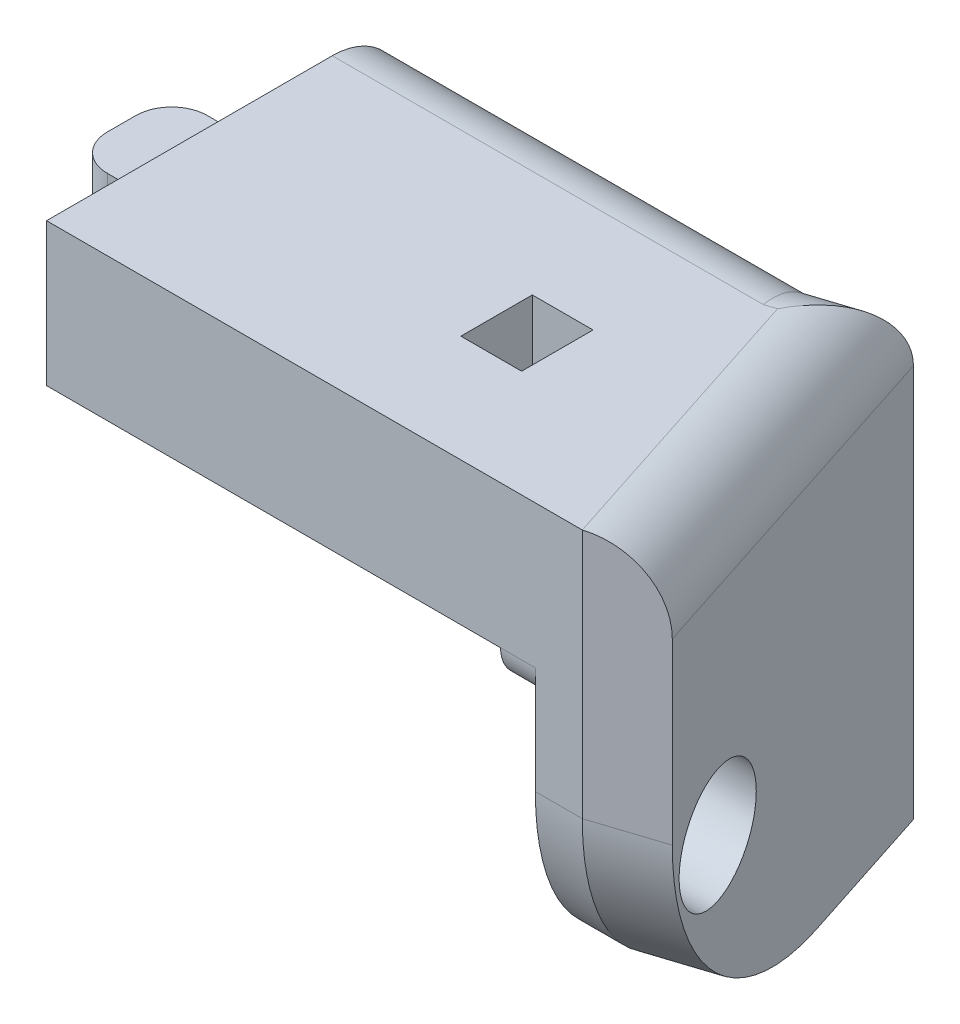
ISO-10303-21;
HEADER;
FILE_DESCRIPTION(('STEP AP214'),'2;1');
FILE_NAME('part.step','',(''),(''),'','','');
FILE_SCHEMA(('AUTOMOTIVE_DESIGN { 1 0 10303 214 1 1 1 1 }'));
ENDSEC;
DATA;
#1=APPLICATION_CONTEXT('core data for automotive mechanical design processes');
#2=APPLICATION_PROTOCOL_DEFINITION('international standard','automotive_design',2000,#1);
#3=PRODUCT_CONTEXT('',#1,'mechanical');
#4=PRODUCT('Part','Part','',(#3));
#5=PRODUCT_RELATED_PRODUCT_CATEGORY('part','',(#4));
#6=PRODUCT_DEFINITION_FORMATION('','',#4);
#7=PRODUCT_DEFINITION_CONTEXT('part definition',#1,'design');
#8=PRODUCT_DEFINITION('design','',#6,#7);
#9=PRODUCT_DEFINITION_SHAPE('','',#8);
#10=(LENGTH_UNIT() NAMED_UNIT(*) SI_UNIT(.MILLI.,.METRE.));
#11=(NAMED_UNIT(*) PLANE_ANGLE_UNIT() SI_UNIT($,.RADIAN.));
#12=(NAMED_UNIT(*) SI_UNIT($,.STERADIAN.) SOLID_ANGLE_UNIT());
#13=UNCERTAINTY_MEASURE_WITH_UNIT(LENGTH_MEASURE(1.E-05),#10,'distance_accuracy_value','');
#14=(GEOMETRIC_REPRESENTATION_CONTEXT(3) GLOBAL_UNCERTAINTY_ASSIGNED_CONTEXT((#13)) GLOBAL_UNIT_ASSIGNED_CONTEXT((#10,
#11,#12)) REPRESENTATION_CONTEXT('',''));
#15=CARTESIAN_POINT('',(0.,0.,0.));
#16=DIRECTION('',(0.,0.,1.));
#17=DIRECTION('',(1.,0.,0.));
#18=AXIS2_PLACEMENT_3D('',#15,#16,#17);
#19=CARTESIAN_POINT('',(0.,20.32,0.));
#20=DIRECTION('',(0.,1.,0.));
#21=DIRECTION('',(0.,0.,1.));
#22=AXIS2_PLACEMENT_3D('',#19,#20,#21);
#23=PLANE('',#22);
#24=DIRECTION('',(1.,0.,0.));
#25=VECTOR('',#24,1.);
#26=CARTESIAN_POINT('',(0.,20.32,22.86));
#27=LINE('',#26,#25);
#28=CARTESIAN_POINT('',(63.7833511252962,20.32,22.86));
#29=VERTEX_POINT('',#28);
#30=CARTESIAN_POINT('',(62.132759068433,20.32,22.86));
#31=VERTEX_POINT('',#30);
#32=EDGE_CURVE('E373',#29,#31,#27,.F.);
#33=ORIENTED_EDGE('',*,*,#32,.T.);
#34=DIRECTION('',(0.,0.,1.));
#35=VECTOR('',#34,1.);
#36=CARTESIAN_POINT('',(62.132759068433,20.32,17.78));
#37=LINE('',#36,#35);
#38=CARTESIAN_POINT('',(62.132759068433,20.32,17.78));
#39=VERTEX_POINT('',#38);
#40=EDGE_CURVE('E226',#39,#31,#37,.T.);
#41=ORIENTED_EDGE('',*,*,#40,.F.);
#42=DIRECTION('',(0.309016994374944,0.,0.951056516295155));
#43=VECTOR('',#42,1.);
#44=CARTESIAN_POINT('',(57.3873069049515,20.32,3.175));
#45=LINE('',#44,#43);
#46=EDGE_CURVE('E375',#39,#29,#45,.T.);
#47=ORIENTED_EDGE('',*,*,#46,.T.);
#48=EDGE_LOOP('',(#33,#41,#47));
#49=FACE_BOUND('',#48,.T.);
#50=ADVANCED_FACE('F33',(#49),#23,.F.);
#51=CARTESIAN_POINT('',(51.6910397156842,12.7,17.78));
#52=DIRECTION('',(0.,0.,1.));
#53=DIRECTION('',(1.,0.,0.));
#54=AXIS2_PLACEMENT_3D('',#51,#52,#53);
#55=PLANE('',#54);
#56=DIRECTION('',(1.,0.,0.));
#57=VECTOR('',#56,1.);
#58=CARTESIAN_POINT('',(62.132759068433,22.86,17.78));
#59=LINE('',#58,#57);
#60=CARTESIAN_POINT('',(51.6910397156842,22.86,17.78));
#61=VERTEX_POINT('',#60);
#62=CARTESIAN_POINT('',(56.0090397156842,22.86,17.78));
#63=VERTEX_POINT('',#62);
#64=EDGE_CURVE('E205',#61,#63,#59,.T.);
#65=ORIENTED_EDGE('',*,*,#64,.F.);
#66=DIRECTION('',(0.,1.,0.));
#67=VECTOR('',#66,1.);
#68=CARTESIAN_POINT('',(51.6910397156842,12.7,17.78));
#69=LINE('',#68,#67);
#70=CARTESIAN_POINT('',(51.6910397156842,33.02,17.78));
#71=VERTEX_POINT('',#70);
#72=EDGE_CURVE('E559',#61,#71,#69,.T.);
#73=ORIENTED_EDGE('',*,*,#72,.T.);
#74=DIRECTION('',(1.,0.,0.));
#75=VECTOR('',#74,1.);
#76=CARTESIAN_POINT('',(51.6910397156842,33.02,17.78));
#77=LINE('',#76,#75);
#78=CARTESIAN_POINT('',(56.0090397156842,33.02,17.78));
#79=VERTEX_POINT('',#78);
#80=EDGE_CURVE('E550',#71,#79,#77,.T.);
#81=ORIENTED_EDGE('',*,*,#80,.T.);
#82=DIRECTION('',(0.,1.,0.));
#83=VECTOR('',#82,1.);
#84=CARTESIAN_POINT('',(56.0090397156842,12.7,17.78));
#85=LINE('',#84,#83);
#86=EDGE_CURVE('E566',#63,#79,#85,.T.);
#87=ORIENTED_EDGE('',*,*,#86,.F.);
#88=EDGE_LOOP('',(#65,#73,#81,#87));
#89=FACE_BOUND('',#88,.T.);
#90=ADVANCED_FACE('F301',(#89),#55,.F.);
#91=CARTESIAN_POINT('',(29.8470397156843,-4.06400000000001,25.4));
#92=DIRECTION('',(1.,0.,0.));
#93=DIRECTION('',(0.,0.,-1.));
#94=AXIS2_PLACEMENT_3D('',#91,#92,#93);
#95=PLANE('',#94);
#96=DIRECTION('',(0.,0.,-1.));
#97=VECTOR('',#96,1.);
#98=CARTESIAN_POINT('',(29.8470397156843,20.32,0.));
#99=LINE('',#98,#97);
#100=CARTESIAN_POINT('',(29.8470397156842,20.32,17.78));
#101=VERTEX_POINT('',#100);
#102=CARTESIAN_POINT('',(29.8470397156843,20.32,0.));
#103=VERTEX_POINT('',#102);
#104=EDGE_CURVE('E265',#101,#103,#99,.T.);
#105=ORIENTED_EDGE('',*,*,#104,.F.);
#106=DIRECTION('',(0.,1.,0.));
#107=VECTOR('',#106,1.);
#108=CARTESIAN_POINT('',(29.8470397156843,-4.06400000000001,17.78));
#109=LINE('',#108,#107);
#110=CARTESIAN_POINT('',(29.8470397156842,22.86,17.78));
#111=VERTEX_POINT('',#110);
#112=EDGE_CURVE('E229',#101,#111,#109,.T.);
#113=ORIENTED_EDGE('',*,*,#112,.T.);
#114=DIRECTION('',(0.,0.,-1.));
#115=VECTOR('',#114,1.);
#116=CARTESIAN_POINT('',(29.8470397156843,22.86,25.4));
#117=LINE('',#116,#115);
#118=CARTESIAN_POINT('',(29.8470397156843,22.86,25.4));
#119=VERTEX_POINT('',#118);
#120=EDGE_CURVE('E217',#119,#111,#117,.T.);
#121=ORIENTED_EDGE('',*,*,#120,.F.);
#122=DIRECTION('',(0.,1.,0.));
#123=VECTOR('',#122,1.);
#124=CARTESIAN_POINT('',(29.8470397156843,-4.06400000000001,25.4));
#125=LINE('',#124,#123);
#126=CARTESIAN_POINT('',(29.8470397156843,33.02,25.4));
#127=VERTEX_POINT('',#126);
#128=EDGE_CURVE('E260',#119,#127,#125,.T.);
#129=ORIENTED_EDGE('',*,*,#128,.T.);
#130=DIRECTION('',(0.,0.,-1.));
#131=VECTOR('',#130,1.);
#132=CARTESIAN_POINT('',(29.8470397156843,33.02,25.4));
#133=LINE('',#132,#131);
#134=CARTESIAN_POINT('',(29.8470397156843,33.02,5.08));
#135=VERTEX_POINT('',#134);
#136=EDGE_CURVE('E258',#127,#135,#133,.T.);
#137=ORIENTED_EDGE('',*,*,#136,.T.);
#138=CARTESIAN_POINT('',(29.8470397156843,27.94,5.08));
#139=DIRECTION('',(1.,0.,0.));
#140=DIRECTION('',(0.,0.,-1.));
#141=AXIS2_PLACEMENT_3D('',#138,#139,#140);
#142=CIRCLE('',#141,5.08);
#143=CARTESIAN_POINT('',(29.8470397156843,27.94,0.));
#144=VERTEX_POINT('',#143);
#145=EDGE_CURVE('E406',#135,#144,#142,.F.);
#146=ORIENTED_EDGE('',*,*,#145,.T.);
#147=DIRECTION('',(0.,1.,0.));
#148=VECTOR('',#147,1.);
#149=CARTESIAN_POINT('',(29.8470397156843,33.02,0.));
#150=LINE('',#149,#148);
#151=EDGE_CURVE('E262',#103,#144,#150,.T.);
#152=ORIENTED_EDGE('',*,*,#151,.F.);
#153=EDGE_LOOP('',(#105,#113,#121,#129,#137,#146,#152));
#154=FACE_BOUND('',#153,.T.);
#155=DIRECTION('',(0.,1.,0.));
#156=VECTOR('',#155,1.);
#157=CARTESIAN_POINT('',(29.8470397156843,31.496,18.796));
#158=LINE('',#157,#156);
#159=CARTESIAN_POINT('',(29.8470397156843,27.686,18.796));
#160=VERTEX_POINT('',#159);
#161=CARTESIAN_POINT('',(29.8470397156843,31.496,18.796));
#162=VERTEX_POINT('',#161);
#163=EDGE_CURVE('E232',#160,#162,#158,.T.);
#164=ORIENTED_EDGE('',*,*,#163,.F.);
#165=DIRECTION('',(0.,0.,1.));
#166=VECTOR('',#165,1.);
#167=CARTESIAN_POINT('',(29.8470397156843,27.686,18.796));
#168=LINE('',#167,#166);
#169=CARTESIAN_POINT('',(29.8470397156843,27.686,11.684));
#170=VERTEX_POINT('',#169);
#171=EDGE_CURVE('E237',#170,#160,#168,.T.);
#172=ORIENTED_EDGE('',*,*,#171,.F.);
#173=DIRECTION('',(0.,-1.,0.));
#174=VECTOR('',#173,1.);
#175=CARTESIAN_POINT('',(29.8470397156843,31.496,11.684));
#176=LINE('',#175,#174);
#177=CARTESIAN_POINT('',(29.8470397156843,31.496,11.684));
#178=VERTEX_POINT('',#177);
#179=EDGE_CURVE('E246',#178,#170,#176,.T.);
#180=ORIENTED_EDGE('',*,*,#179,.F.);
#181=DIRECTION('',(0.,0.,-1.));
#182=VECTOR('',#181,1.);
#183=CARTESIAN_POINT('',(29.8470397156843,31.496,18.796));
#184=LINE('',#183,#182);
#185=EDGE_CURVE('E243',#162,#178,#184,.T.);
#186=ORIENTED_EDGE('',*,*,#185,.F.);
#187=EDGE_LOOP('',(#164,#172,#180,#186));
#188=FACE_BOUND('',#187,.T.);
#189=ADVANCED_FACE('F304',(#154,#188),#95,.F.);
#190=CARTESIAN_POINT('',(0.,0.,0.));
#191=DIRECTION('',(0.,1.,0.));
#192=DIRECTION('',(0.,0.,1.));
#193=AXIS2_PLACEMENT_3D('',#190,#191,#192);
#194=PLANE('',#193);
#195=DIRECTION('',(-1.,0.,0.));
#196=VECTOR('',#195,1.);
#197=CARTESIAN_POINT('',(59.6940794313685,0.,0.));
#198=LINE('',#197,#196);
#199=CARTESIAN_POINT('',(59.6940794313685,0.,0.));
#200=VERTEX_POINT('',#199);
#201=CARTESIAN_POINT('',(56.355686869412,0.,0.));
#202=VERTEX_POINT('',#201);
#203=EDGE_CURVE('E488',#200,#202,#198,.T.);
#204=ORIENTED_EDGE('',*,*,#203,.F.);
#205=DIRECTION('',(-0.951056516295155,0.,0.309016994374944));
#206=VECTOR('',#205,1.);
#207=CARTESIAN_POINT('',(64.5254465341479,0.,-1.56980633142472));
#208=LINE('',#207,#206);
#209=CARTESIAN_POINT('',(64.5254465341479,0.,-1.56980633142472));
#210=VERTEX_POINT('',#209);
#211=EDGE_CURVE('E473',#210,#200,#208,.T.);
#212=ORIENTED_EDGE('',*,*,#211,.F.);
#213=DIRECTION('',(-0.309016994374945,0.,-0.951056516295155));
#214=VECTOR('',#213,1.);
#215=CARTESIAN_POINT('',(67.8266306478742,0.,8.59019366857529));
#216=LINE('',#215,#214);
#217=CARTESIAN_POINT('',(67.8266306478742,0.,8.59019366857529));
#218=VERTEX_POINT('',#217);
#219=EDGE_CURVE('E277',#218,#210,#216,.T.);
#220=ORIENTED_EDGE('',*,*,#219,.F.);
#221=DIRECTION('',(-0.951056516295155,0.,0.309016994374944));
#222=VECTOR('',#221,1.);
#223=CARTESIAN_POINT('',(67.8266306478742,0.,8.59019366857529));
#224=LINE('',#223,#222);
#225=CARTESIAN_POINT('',(62.9952635450948,0.,10.16));
#226=VERTEX_POINT('',#225);
#227=EDGE_CURVE('E540',#218,#226,#224,.T.);
#228=ORIENTED_EDGE('',*,*,#227,.T.);
#229=DIRECTION('',(1.,0.,0.));
#230=VECTOR('',#229,1.);
#231=CARTESIAN_POINT('',(0.,0.,10.16));
#232=LINE('',#231,#230);
#233=CARTESIAN_POINT('',(59.6568709831383,0.,10.16));
#234=VERTEX_POINT('',#233);
#235=EDGE_CURVE('E508',#226,#234,#232,.F.);
#236=ORIENTED_EDGE('',*,*,#235,.T.);
#237=DIRECTION('',(-0.309016994374946,0.,-0.951056516295154));
#238=VECTOR('',#237,1.);
#239=CARTESIAN_POINT('',(50.9741976382197,0.,-16.5625208123264));
#240=LINE('',#239,#238);
#241=EDGE_CURVE('E498',#234,#202,#240,.T.);
#242=ORIENTED_EDGE('',*,*,#241,.T.);
#243=EDGE_LOOP('',(#204,#212,#220,#228,#236,#242));
#244=FACE_BOUND('',#243,.T.);
#245=ADVANCED_FACE('F323',(#244),#194,.F.);
#246=CARTESIAN_POINT('',(59.6940794313685,33.02,0.));
#247=DIRECTION('',(0.,0.,1.));
#248=DIRECTION('',(1.,0.,0.));
#249=AXIS2_PLACEMENT_3D('',#246,#247,#248);
#250=PLANE('',#249);
#251=DIRECTION('',(-1.,0.,0.));
#252=VECTOR('',#251,1.);
#253=CARTESIAN_POINT('',(59.6940794313685,20.32,0.));
#254=LINE('',#253,#252);
#255=CARTESIAN_POINT('',(56.355686869412,20.32,0.));
#256=VERTEX_POINT('',#255);
#257=EDGE_CURVE('E529',#256,#103,#254,.T.);
#258=ORIENTED_EDGE('',*,*,#257,.T.);
#259=ORIENTED_EDGE('',*,*,#151,.T.);
#260=DIRECTION('',(-1.,0.,0.));
#261=VECTOR('',#260,1.);
#262=CARTESIAN_POINT('',(59.6940794313685,27.94,0.));
#263=LINE('',#262,#261);
#264=CARTESIAN_POINT('',(59.6940794313685,27.94,0.));
#265=VERTEX_POINT('',#264);
#266=EDGE_CURVE('E404',#144,#265,#263,.F.);
#267=ORIENTED_EDGE('',*,*,#266,.T.);
#268=DIRECTION('',(0.,-1.,0.));
#269=VECTOR('',#268,1.);
#270=CARTESIAN_POINT('',(59.6940794313685,33.02,0.));
#271=LINE('',#270,#269);
#272=EDGE_CURVE('E487',#265,#200,#271,.T.);
#273=ORIENTED_EDGE('',*,*,#272,.T.);
#274=ORIENTED_EDGE('',*,*,#203,.T.);
#275=DIRECTION('',(0.,1.,0.));
#276=VECTOR('',#275,1.);
#277=CARTESIAN_POINT('',(56.355686869412,33.02,0.));
#278=LINE('',#277,#276);
#279=EDGE_CURVE('E525',#202,#256,#278,.T.);
#280=ORIENTED_EDGE('',*,*,#279,.T.);
#281=EDGE_LOOP('',(#258,#259,#267,#273,#274,#280));
#282=FACE_BOUND('',#281,.T.);
#283=ADVANCED_FACE('F326',(#282),#250,.F.);
#284=CARTESIAN_POINT('',(-8.25296028431574,33.02,25.4));
#285=DIRECTION('',(0.,0.,-1.));
#286=DIRECTION('',(-1.,0.,0.));
#287=AXIS2_PLACEMENT_3D('',#284,#285,#286);
#288=PLANE('',#287);
#289=DIRECTION('',(1.,0.,0.));
#290=VECTOR('',#289,1.);
#291=CARTESIAN_POINT('',(-8.25296028431574,33.02,25.4));
#292=LINE('',#291,#290);
#293=CARTESIAN_POINT('',(67.9470397156843,33.02,25.4));
#294=VERTEX_POINT('',#293);
#295=EDGE_CURVE('E484',#127,#294,#292,.T.);
#296=ORIENTED_EDGE('',*,*,#295,.F.);
#297=ORIENTED_EDGE('',*,*,#128,.F.);
#298=DIRECTION('',(1.,0.,0.));
#299=VECTOR('',#298,1.);
#300=CARTESIAN_POINT('',(-8.25296028431574,22.86,25.4));
#301=LINE('',#300,#299);
#302=CARTESIAN_POINT('',(62.132759068433,22.86,25.4));
#303=VERTEX_POINT('',#302);
#304=EDGE_CURVE('E379',#119,#303,#301,.T.);
#305=ORIENTED_EDGE('',*,*,#304,.T.);
#306=CARTESIAN_POINT('',(64.6086471537278,22.86,25.4));
#307=VERTEX_POINT('',#306);
#308=EDGE_CURVE('E384',#303,#307,#301,.T.);
#309=ORIENTED_EDGE('',*,*,#308,.T.);
#310=DIRECTION('',(0.,-1.,0.));
#311=VECTOR('',#310,1.);
#312=CARTESIAN_POINT('',(64.6086471537278,33.02,25.4));
#313=LINE('',#312,#311);
#314=CARTESIAN_POINT('',(64.6086471537278,15.24,25.4));
#315=VERTEX_POINT('',#314);
#316=EDGE_CURVE('E521',#307,#315,#313,.T.);
#317=ORIENTED_EDGE('',*,*,#316,.T.);
#318=DIRECTION('',(1.,0.,0.));
#319=VECTOR('',#318,1.);
#320=CARTESIAN_POINT('',(-8.25296028431574,15.24,25.4));
#321=LINE('',#320,#319);
#322=CARTESIAN_POINT('',(67.9470397156843,15.24,25.4));
#323=VERTEX_POINT('',#322);
#324=EDGE_CURVE('E497',#315,#323,#321,.T.);
#325=ORIENTED_EDGE('',*,*,#324,.T.);
#326=DIRECTION('',(0.,-1.,0.));
#327=VECTOR('',#326,1.);
#328=CARTESIAN_POINT('',(67.9470397156843,33.02,25.4));
#329=LINE('',#328,#327);
#330=EDGE_CURVE('E492',#294,#323,#329,.T.);
#331=ORIENTED_EDGE('',*,*,#330,.F.);
#332=EDGE_LOOP('',(#296,#297,#305,#309,#317,#325,#331));
#333=FACE_BOUND('',#332,.T.);
#334=ADVANCED_FACE('F321',(#333),#288,.F.);
#335=CARTESIAN_POINT('',(0.,33.02,0.));
#336=DIRECTION('',(0.,1.,0.));
#337=DIRECTION('',(0.,0.,1.));
#338=AXIS2_PLACEMENT_3D('',#335,#336,#337);
#339=PLANE('',#338);
#340=ORIENTED_EDGE('',*,*,#136,.F.);
#341=ORIENTED_EDGE('',*,*,#295,.T.);
#342=DIRECTION('',(0.309016994374944,0.,0.951056516295155));
#343=VECTOR('',#342,1.);
#344=CARTESIAN_POINT('',(53.9938020774569,33.02,-17.5436497694668));
#345=LINE('',#344,#343);
#346=CARTESIAN_POINT('',(61.2638857627932,33.02,4.83136710277938));
#347=VERTEX_POINT('',#346);
#348=EDGE_CURVE('E395',#294,#347,#345,.F.);
#349=ORIENTED_EDGE('',*,*,#348,.T.);
#350=DIRECTION('',(-0.951056516295155,0.,0.309016994374944));
#351=VECTOR('',#350,1.);
#352=CARTESIAN_POINT('',(61.2638857627933,33.02,4.83136710277938));
#353=LINE('',#352,#351);
#354=CARTESIAN_POINT('',(60.4986723882172,33.02,5.08));
#355=VERTEX_POINT('',#354);
#356=EDGE_CURVE('E393',#347,#355,#353,.T.);
#357=ORIENTED_EDGE('',*,*,#356,.T.);
#358=DIRECTION('',(-1.,0.,0.));
#359=VECTOR('',#358,1.);
#360=CARTESIAN_POINT('',(0.,33.02,5.08));
#361=LINE('',#360,#359);
#362=EDGE_CURVE('E381',#355,#135,#361,.T.);
#363=ORIENTED_EDGE('',*,*,#362,.T.);
#364=EDGE_LOOP('',(#340,#341,#349,#357,#363));
#365=FACE_BOUND('',#364,.T.);
#366=DIRECTION('',(0.,0.,1.));
#367=VECTOR('',#366,1.);
#368=CARTESIAN_POINT('',(51.6910397156842,33.02,17.78));
#369=LINE('',#368,#367);
#370=CARTESIAN_POINT('',(51.6910397156842,33.02,12.7));
#371=VERTEX_POINT('',#370);
#372=EDGE_CURVE('E547',#371,#71,#369,.T.);
#373=ORIENTED_EDGE('',*,*,#372,.F.);
#374=DIRECTION('',(-1.,0.,0.));
#375=VECTOR('',#374,1.);
#376=CARTESIAN_POINT('',(51.6910397156842,33.02,12.7));
#377=LINE('',#376,#375);
#378=CARTESIAN_POINT('',(56.0090397156842,33.02,12.7));
#379=VERTEX_POINT('',#378);
#380=EDGE_CURVE('E556',#379,#371,#377,.T.);
#381=ORIENTED_EDGE('',*,*,#380,.F.);
#382=DIRECTION('',(0.,0.,-1.));
#383=VECTOR('',#382,1.);
#384=CARTESIAN_POINT('',(56.0090397156842,33.02,17.78));
#385=LINE('',#384,#383);
#386=EDGE_CURVE('E553',#79,#379,#385,.T.);
#387=ORIENTED_EDGE('',*,*,#386,.F.);
#388=ORIENTED_EDGE('',*,*,#80,.F.);
#389=EDGE_LOOP('',(#373,#381,#387,#388));
#390=FACE_BOUND('',#389,.T.);
#391=ADVANCED_FACE('F314',(#365,#390),#339,.T.);
#392=EDGE_CURVE('E526',#256,#39,#45,.T.);
#393=ORIENTED_EDGE('',*,*,#392,.T.);
#394=DIRECTION('',(1.,0.,0.));
#395=VECTOR('',#394,1.);
#396=CARTESIAN_POINT('',(62.132759068433,20.32,17.78));
#397=LINE('',#396,#395);
#398=CARTESIAN_POINT('',(56.0090397156842,20.32,17.78));
#399=VERTEX_POINT('',#398);
#400=EDGE_CURVE('E214',#399,#39,#397,.T.);
#401=ORIENTED_EDGE('',*,*,#400,.F.);
#402=DIRECTION('',(0.,0.,-1.));
#403=VECTOR('',#402,1.);
#404=CARTESIAN_POINT('',(56.0090397156842,20.32,0.));
#405=LINE('',#404,#403);
#406=CARTESIAN_POINT('',(56.0090397156842,20.32,12.7));
#407=VERTEX_POINT('',#406);
#408=EDGE_CURVE('E512',#399,#407,#405,.T.);
#409=ORIENTED_EDGE('',*,*,#408,.T.);
#410=DIRECTION('',(-1.,0.,0.));
#411=VECTOR('',#410,1.);
#412=CARTESIAN_POINT('',(0.,20.32,12.7));
#413=LINE('',#412,#411);
#414=CARTESIAN_POINT('',(51.6910397156842,20.32,12.7));
#415=VERTEX_POINT('',#414);
#416=EDGE_CURVE('E515',#407,#415,#413,.T.);
#417=ORIENTED_EDGE('',*,*,#416,.T.);
#418=DIRECTION('',(0.,0.,1.));
#419=VECTOR('',#418,1.);
#420=CARTESIAN_POINT('',(51.6910397156842,20.32,0.));
#421=LINE('',#420,#419);
#422=CARTESIAN_POINT('',(51.6910397156842,20.32,17.78));
#423=VERTEX_POINT('',#422);
#424=EDGE_CURVE('E517',#415,#423,#421,.T.);
#425=ORIENTED_EDGE('',*,*,#424,.T.);
#426=EDGE_CURVE('E222',#101,#423,#397,.T.);
#427=ORIENTED_EDGE('',*,*,#426,.F.);
#428=ORIENTED_EDGE('',*,*,#104,.T.);
#429=ORIENTED_EDGE('',*,*,#257,.F.);
#430=EDGE_LOOP('',(#393,#401,#409,#417,#425,#427,#428,#429));
#431=FACE_BOUND('',#430,.T.);
#432=ADVANCED_FACE('F310',(#431),#23,.F.);
#433=CARTESIAN_POINT('',(63.5770271181883,20.32,22.225));
#434=DIRECTION('',(0.951056516295154,0.,-0.309016994374946));
#435=DIRECTION('',(-0.309016994374946,0.,-0.951056516295154));
#436=AXIS2_PLACEMENT_3D('',#433,#434,#435);
#437=PLANE('',#436);
#438=CARTESIAN_POINT('',(62.5454070826488,12.7,19.05));
#439=DIRECTION('',(0.951056516295154,0.,-0.309016994374946));
#440=DIRECTION('',(-0.309016994374946,0.,-0.951056516295154));
#441=AXIS2_PLACEMENT_3D('',#438,#439,#440);
#442=ELLIPSE('',#441,4.27314247930431,4.064);
#443=CARTESIAN_POINT('',(61.2249334371583,12.7,14.986));
#444=VERTEX_POINT('',#443);
#445=EDGE_CURVE('E268',#444,#444,#442,.F.);
#446=ORIENTED_EDGE('',*,*,#445,.F.);
#447=EDGE_LOOP('',(#446));
#448=FACE_BOUND('',#447,.T.);
#449=ORIENTED_EDGE('',*,*,#241,.F.);
#450=CARTESIAN_POINT('',(59.6568709831383,15.24,10.16));
#451=DIRECTION('',(0.951056516295154,0.,-0.309016994374946));
#452=DIRECTION('',(0.309016994374946,0.,0.951056516295154));
#453=AXIS2_PLACEMENT_3D('',#450,#451,#452);
#454=ELLIPSE('',#453,16.0242842973912,15.24);
#455=EDGE_CURVE('E510',#234,#315,#454,.F.);
#456=ORIENTED_EDGE('',*,*,#455,.T.);
#457=ORIENTED_EDGE('',*,*,#316,.F.);
#458=CARTESIAN_POINT('',(63.7833511252962,22.86,22.86));
#459=DIRECTION('',(0.951056516295154,0.,-0.309016994374946));
#460=DIRECTION('',(0.309016994374946,0.,0.951056516295154));
#461=AXIS2_PLACEMENT_3D('',#458,#459,#460);
#462=ELLIPSE('',#461,2.6707140495652,2.54);
#463=EDGE_CURVE('E378',#307,#29,#462,.T.);
#464=ORIENTED_EDGE('',*,*,#463,.T.);
#465=ORIENTED_EDGE('',*,*,#46,.F.);
#466=ORIENTED_EDGE('',*,*,#392,.F.);
#467=ORIENTED_EDGE('',*,*,#279,.F.);
#468=EDGE_LOOP('',(#449,#456,#457,#464,#465,#466,#467));
#469=FACE_BOUND('',#468,.T.);
#470=ADVANCED_FACE('F313',(#448,#469),#437,.F.);
#471=CARTESIAN_POINT('',(-8.25296028431574,15.24,10.16));
#472=DIRECTION('',(1.,0.,0.));
#473=DIRECTION('',(0.,0.,-1.));
#474=AXIS2_PLACEMENT_3D('',#471,#472,#473);
#475=CYLINDRICAL_SURFACE('',#474,15.24);
#476=ORIENTED_EDGE('',*,*,#455,.F.);
#477=ORIENTED_EDGE('',*,*,#235,.F.);
#478=CARTESIAN_POINT('',(62.9952635450948,15.24,10.16));
#479=DIRECTION('',(-0.951056516295155,0.,0.309016994374944));
#480=DIRECTION('',(0.309016994374944,0.,0.951056516295155));
#481=AXIS2_PLACEMENT_3D('',#478,#479,#480);
#482=ELLIPSE('',#481,16.0242842973912,15.24);
#483=EDGE_CURVE('E505',#323,#226,#482,.F.);
#484=ORIENTED_EDGE('',*,*,#483,.F.);
#485=ORIENTED_EDGE('',*,*,#324,.F.);
#486=EDGE_LOOP('',(#476,#477,#484,#485));
#487=FACE_BOUND('',#486,.T.);
#488=ADVANCED_FACE('F308',(#487),#475,.T.);
#489=CARTESIAN_POINT('',(51.6910397156842,12.7,17.78));
#490=DIRECTION('',(-1.,0.,0.));
#491=DIRECTION('',(0.,0.,1.));
#492=AXIS2_PLACEMENT_3D('',#489,#490,#491);
#493=PLANE('',#492);
#494=DIRECTION('',(0.,1.,0.));
#495=VECTOR('',#494,1.);
#496=CARTESIAN_POINT('',(51.6910397156842,12.7,12.7));
#497=LINE('',#496,#495);
#498=EDGE_CURVE('E560',#415,#371,#497,.T.);
#499=ORIENTED_EDGE('',*,*,#498,.T.);
#500=ORIENTED_EDGE('',*,*,#372,.T.);
#501=ORIENTED_EDGE('',*,*,#72,.F.);
#502=EDGE_CURVE('E567',#423,#61,#69,.T.);
#503=ORIENTED_EDGE('',*,*,#502,.F.);
#504=ORIENTED_EDGE('',*,*,#424,.F.);
#505=EDGE_LOOP('',(#499,#500,#501,#503,#504));
#506=FACE_BOUND('',#505,.T.);
#507=ADVANCED_FACE('F296',(#506),#493,.F.);
#508=CARTESIAN_POINT('',(51.6910397156842,12.7,12.7));
#509=DIRECTION('',(0.,0.,-1.));
#510=DIRECTION('',(-1.,0.,0.));
#511=AXIS2_PLACEMENT_3D('',#508,#509,#510);
#512=PLANE('',#511);
#513=DIRECTION('',(0.,1.,0.));
#514=VECTOR('',#513,1.);
#515=CARTESIAN_POINT('',(56.0090397156842,12.7,12.7));
#516=LINE('',#515,#514);
#517=EDGE_CURVE('E562',#407,#379,#516,.T.);
#518=ORIENTED_EDGE('',*,*,#517,.T.);
#519=ORIENTED_EDGE('',*,*,#380,.T.);
#520=ORIENTED_EDGE('',*,*,#498,.F.);
#521=ORIENTED_EDGE('',*,*,#416,.F.);
#522=EDGE_LOOP('',(#518,#519,#520,#521));
#523=FACE_BOUND('',#522,.T.);
#524=ADVANCED_FACE('F292',(#523),#512,.F.);
#525=CARTESIAN_POINT('',(56.0090397156842,12.7,17.78));
#526=DIRECTION('',(1.,0.,0.));
#527=DIRECTION('',(0.,0.,-1.));
#528=AXIS2_PLACEMENT_3D('',#525,#526,#527);
#529=PLANE('',#528);
#530=EDGE_CURVE('E564',#399,#63,#85,.T.);
#531=ORIENTED_EDGE('',*,*,#530,.T.);
#532=ORIENTED_EDGE('',*,*,#86,.T.);
#533=ORIENTED_EDGE('',*,*,#386,.T.);
#534=ORIENTED_EDGE('',*,*,#517,.F.);
#535=ORIENTED_EDGE('',*,*,#408,.F.);
#536=EDGE_LOOP('',(#531,#532,#533,#534,#535));
#537=FACE_BOUND('',#536,.T.);
#538=ADVANCED_FACE('F295',(#537),#529,.F.);
#539=CARTESIAN_POINT('',(-8.25296028431574,22.86,22.86));
#540=DIRECTION('',(1.,0.,0.));
#541=DIRECTION('',(0.,0.,-1.));
#542=AXIS2_PLACEMENT_3D('',#539,#540,#541);
#543=CYLINDRICAL_SURFACE('',#542,2.54);
#544=CARTESIAN_POINT('',(62.132759068433,22.86,22.86));
#545=DIRECTION('',(1.,0.,0.));
#546=DIRECTION('',(0.,0.,-1.));
#547=AXIS2_PLACEMENT_3D('',#544,#545,#546);
#548=CIRCLE('',#547,2.54);
#549=EDGE_CURVE('E11',#31,#303,#548,.F.);
#550=ORIENTED_EDGE('',*,*,#549,.F.);
#551=ORIENTED_EDGE('',*,*,#32,.F.);
#552=ORIENTED_EDGE('',*,*,#463,.F.);
#553=ORIENTED_EDGE('',*,*,#308,.F.);
#554=EDGE_LOOP('',(#550,#551,#552,#553));
#555=FACE_BOUND('',#554,.T.);
#556=ADVANCED_FACE('F290',(#555),#543,.T.);
#557=CARTESIAN_POINT('',(72.7784068184637,33.02,23.8301936685753));
#558=DIRECTION('',(-0.309016994374944,0.,-0.951056516295155));
#559=DIRECTION('',(-0.951056516295155,0.,0.309016994374944));
#560=AXIS2_PLACEMENT_3D('',#557,#558,#559);
#561=PLANE('',#560);
#562=DIRECTION('',(0.,-1.,0.));
#563=VECTOR('',#562,1.);
#564=CARTESIAN_POINT('',(72.7784068184637,33.02,23.8301936685753));
#565=LINE('',#564,#563);
#566=CARTESIAN_POINT('',(72.7784068184637,27.94,23.8301936685753));
#567=VERTEX_POINT('',#566);
#568=CARTESIAN_POINT('',(72.7784068184637,15.24,23.8301936685753));
#569=VERTEX_POINT('',#568);
#570=EDGE_CURVE('E271',#567,#569,#565,.T.);
#571=ORIENTED_EDGE('',*,*,#570,.F.);
#572=CARTESIAN_POINT('',(67.9470397156843,27.94,25.4));
#573=DIRECTION('',(-0.309016994374944,0.,-0.951056516295155));
#574=DIRECTION('',(-0.951056516295155,0.,0.309016994374944));
#575=AXIS2_PLACEMENT_3D('',#572,#573,#574);
#576=CIRCLE('',#575,5.08);
#577=EDGE_CURVE('E399',#567,#294,#576,.F.);
#578=ORIENTED_EDGE('',*,*,#577,.T.);
#579=ORIENTED_EDGE('',*,*,#330,.T.);
#580=DIRECTION('',(-0.951056516295155,0.,0.309016994374944));
#581=VECTOR('',#580,1.);
#582=CARTESIAN_POINT('',(72.7784068184637,15.24,23.8301936685753));
#583=LINE('',#582,#581);
#584=EDGE_CURVE('E543',#569,#323,#583,.T.);
#585=ORIENTED_EDGE('',*,*,#584,.F.);
#586=EDGE_LOOP('',(#571,#578,#579,#585));
#587=FACE_BOUND('',#586,.T.);
#588=ADVANCED_FACE('F285',(#587),#561,.F.);
#589=CARTESIAN_POINT('',(67.8266306478742,15.24,8.59019366857529));
#590=DIRECTION('',(0.951056516295155,0.,-0.309016994374944));
#591=DIRECTION('',(0.309016994374944,0.,0.951056516295155));
#592=AXIS2_PLACEMENT_3D('',#589,#590,#591);
#593=ELLIPSE('',#592,16.0242842973912,15.24);
#594=DIRECTION('',(-0.951056516295155,0.,0.309016994374944));
#595=VECTOR('',#594,1.);
#596=SURFACE_OF_LINEAR_EXTRUSION('',#593,#595);
#597=ORIENTED_EDGE('',*,*,#483,.T.);
#598=ORIENTED_EDGE('',*,*,#227,.F.);
#599=EDGE_CURVE('E274',#569,#218,#593,.T.);
#600=ORIENTED_EDGE('',*,*,#599,.F.);
#601=ORIENTED_EDGE('',*,*,#584,.T.);
#602=EDGE_LOOP('',(#597,#598,#600,#601));
#603=FACE_BOUND('',#602,.T.);
#604=ADVANCED_FACE('F280',(#603),#596,.F.);
#605=CARTESIAN_POINT('',(64.5254465341479,0.,-1.56980633142472));
#606=DIRECTION('',(0.309016994374944,0.,0.951056516295155));
#607=DIRECTION('',(0.951056516295155,0.,-0.309016994374944));
#608=AXIS2_PLACEMENT_3D('',#605,#606,#607);
#609=PLANE('',#608);
#610=ORIENTED_EDGE('',*,*,#272,.F.);
#611=DIRECTION('',(-0.951056516295155,0.,0.309016994374944));
#612=VECTOR('',#611,1.);
#613=CARTESIAN_POINT('',(64.5254465341479,27.94,-1.56980633142472));
#614=LINE('',#613,#612);
#615=CARTESIAN_POINT('',(64.5254465341479,27.94,-1.56980633142472));
#616=VERTEX_POINT('',#615);
#617=EDGE_CURVE('E402',#265,#616,#614,.F.);
#618=ORIENTED_EDGE('',*,*,#617,.T.);
#619=DIRECTION('',(0.,1.,0.));
#620=VECTOR('',#619,1.);
#621=CARTESIAN_POINT('',(64.5254465341479,0.,-1.56980633142472));
#622=LINE('',#621,#620);
#623=EDGE_CURVE('E467',#210,#616,#622,.T.);
#624=ORIENTED_EDGE('',*,*,#623,.F.);
#625=ORIENTED_EDGE('',*,*,#211,.T.);
#626=EDGE_LOOP('',(#610,#618,#624,#625));
#627=FACE_BOUND('',#626,.T.);
#628=ADVANCED_FACE('F284',(#627),#609,.F.);
#629=CARTESIAN_POINT('',(67.8266306478742,15.24,8.59019366857529));
#630=DIRECTION('',(0.951056516295155,0.,-0.309016994374944));
#631=DIRECTION('',(-0.309016994374944,0.,-0.951056516295155));
#632=AXIS2_PLACEMENT_3D('',#629,#630,#631);
#633=PLANE('',#632);
#634=CARTESIAN_POINT('',(71.2252277437357,12.7,19.05));
#635=DIRECTION('',(0.951056516295155,0.,-0.309016994374944));
#636=DIRECTION('',(-0.309016994374944,0.,-0.951056516295155));
#637=AXIS2_PLACEMENT_3D('',#634,#635,#636);
#638=ELLIPSE('',#637,4.27314247930431,4.064);
#639=CARTESIAN_POINT('',(69.9047540982452,12.7,14.986));
#640=VERTEX_POINT('',#639);
#641=EDGE_CURVE('E272',#640,#640,#638,.F.);
#642=ORIENTED_EDGE('',*,*,#641,.T.);
#643=EDGE_LOOP('',(#642));
#644=FACE_BOUND('',#643,.T.);
#645=ORIENTED_EDGE('',*,*,#623,.T.);
#646=DIRECTION('',(0.309016994374944,0.,0.951056516295155));
#647=VECTOR('',#646,1.);
#648=CARTESIAN_POINT('',(67.8266306478742,27.94,8.59019366857529));
#649=LINE('',#648,#647);
#650=EDGE_CURVE('E397',#616,#567,#649,.T.);
#651=ORIENTED_EDGE('',*,*,#650,.T.);
#652=ORIENTED_EDGE('',*,*,#570,.T.);
#653=ORIENTED_EDGE('',*,*,#599,.T.);
#654=ORIENTED_EDGE('',*,*,#219,.T.);
#655=EDGE_LOOP('',(#645,#651,#652,#653,#654));
#656=FACE_BOUND('',#655,.T.);
#657=ADVANCED_FACE('F455',(#644,#656),#633,.T.);
#658=CARTESIAN_POINT('',(88.392,12.7,19.05));
#659=DIRECTION('',(-1.,0.,0.));
#660=DIRECTION('',(0.,0.,1.));
#661=AXIS2_PLACEMENT_3D('',#658,#659,#660);
#662=CYLINDRICAL_SURFACE('',#661,4.064);
#663=ORIENTED_EDGE('',*,*,#641,.F.);
#664=EDGE_LOOP('',(#663));
#665=FACE_BOUND('',#664,.T.);
#666=ORIENTED_EDGE('',*,*,#445,.T.);
#667=EDGE_LOOP('',(#666));
#668=FACE_BOUND('',#667,.T.);
#669=ADVANCED_FACE('F351',(#665,#668),#662,.F.);
#670=CARTESIAN_POINT('',(62.9952635450948,27.94,10.16));
#671=DIRECTION('',(0.309016994374944,0.,0.951056516295155));
#672=DIRECTION('',(0.951056516295155,0.,-0.309016994374944));
#673=AXIS2_PLACEMENT_3D('',#670,#671,#672);
#674=CYLINDRICAL_SURFACE('',#673,5.08);
#675=ORIENTED_EDGE('',*,*,#577,.F.);
#676=ORIENTED_EDGE('',*,*,#650,.F.);
#677=CARTESIAN_POINT('',(61.2638857627933,27.94,4.83136710277938));
#678=DIRECTION('',(0.891006524188366,0.,0.45399049973955));
#679=DIRECTION('',(0.45399049973955,0.,-0.891006524188366));
#680=AXIS2_PLACEMENT_3D('',#677,#678,#679);
#681=ELLIPSE('',#680,7.18420489685532,5.08);
#682=EDGE_CURVE('E390',#347,#616,#681,.F.);
#683=ORIENTED_EDGE('',*,*,#682,.F.);
#684=ORIENTED_EDGE('',*,*,#348,.F.);
#685=EDGE_LOOP('',(#675,#676,#683,#684));
#686=FACE_BOUND('',#685,.T.);
#687=ADVANCED_FACE('F348',(#686),#674,.T.);
#688=CARTESIAN_POINT('',(7.2700836853363,27.94,22.3750168722462));
#689=DIRECTION('',(0.951056516295155,0.,-0.309016994374944));
#690=DIRECTION('',(-0.309016994374944,0.,-0.951056516295155));
#691=AXIS2_PLACEMENT_3D('',#688,#689,#690);
#692=CYLINDRICAL_SURFACE('',#691,5.08);
#693=ORIENTED_EDGE('',*,*,#682,.T.);
#694=ORIENTED_EDGE('',*,*,#617,.F.);
#695=CARTESIAN_POINT('',(60.4986723882171,27.94,5.08));
#696=DIRECTION('',(0.987688340595138,0.,-0.156434465040229));
#697=DIRECTION('',(-0.156434465040229,0.,-0.987688340595138));
#698=AXIS2_PLACEMENT_3D('',#695,#696,#697);
#699=ELLIPSE('',#698,5.14332283900305,5.08);
#700=EDGE_CURVE('E267',#355,#265,#699,.F.);
#701=ORIENTED_EDGE('',*,*,#700,.F.);
#702=ORIENTED_EDGE('',*,*,#356,.F.);
#703=EDGE_LOOP('',(#693,#694,#701,#702));
#704=FACE_BOUND('',#703,.T.);
#705=ADVANCED_FACE('F344',(#704),#692,.T.);
#706=CARTESIAN_POINT('',(0.,27.94,5.08));
#707=DIRECTION('',(1.,0.,0.));
#708=DIRECTION('',(0.,0.,-1.));
#709=AXIS2_PLACEMENT_3D('',#706,#707,#708);
#710=CYLINDRICAL_SURFACE('',#709,5.08);
#711=ORIENTED_EDGE('',*,*,#145,.F.);
#712=ORIENTED_EDGE('',*,*,#362,.F.);
#713=ORIENTED_EDGE('',*,*,#700,.T.);
#714=ORIENTED_EDGE('',*,*,#266,.F.);
#715=EDGE_LOOP('',(#711,#712,#713,#714));
#716=FACE_BOUND('',#715,.T.);
#717=ADVANCED_FACE('F340',(#716),#710,.T.);
#718=CARTESIAN_POINT('',(25.0210397156842,31.496,18.796));
#719=DIRECTION('',(0.,0.,-1.));
#720=DIRECTION('',(-1.,0.,0.));
#721=AXIS2_PLACEMENT_3D('',#718,#719,#720);
#722=PLANE('',#721);
#723=DIRECTION('',(1.,0.,0.));
#724=VECTOR('',#723,1.);
#725=CARTESIAN_POINT('',(25.0210397156842,31.496,18.796));
#726=LINE('',#725,#724);
#727=CARTESIAN_POINT('',(27.5610397156842,31.496,18.796));
#728=VERTEX_POINT('',#727);
#729=EDGE_CURVE('E256',#728,#162,#726,.T.);
#730=ORIENTED_EDGE('',*,*,#729,.F.);
#731=DIRECTION('',(0.,1.,0.));
#732=VECTOR('',#731,1.);
#733=CARTESIAN_POINT('',(27.5610397156842,31.496,18.796));
#734=LINE('',#733,#732);
#735=CARTESIAN_POINT('',(27.5610397156842,27.686,18.796));
#736=VERTEX_POINT('',#735);
#737=EDGE_CURVE('E422',#728,#736,#734,.F.);
#738=ORIENTED_EDGE('',*,*,#737,.T.);
#739=DIRECTION('',(1.,0.,0.));
#740=VECTOR('',#739,1.);
#741=CARTESIAN_POINT('',(25.0210397156842,27.686,18.796));
#742=LINE('',#741,#740);
#743=EDGE_CURVE('E240',#736,#160,#742,.T.);
#744=ORIENTED_EDGE('',*,*,#743,.T.);
#745=ORIENTED_EDGE('',*,*,#163,.T.);
#746=EDGE_LOOP('',(#730,#738,#744,#745));
#747=FACE_BOUND('',#746,.T.);
#748=ADVANCED_FACE('F343',(#747),#722,.F.);
#749=CARTESIAN_POINT('',(25.0210397156842,31.496,18.796));
#750=DIRECTION('',(0.,-1.,0.));
#751=DIRECTION('',(0.,0.,-1.));
#752=AXIS2_PLACEMENT_3D('',#749,#750,#751);
#753=PLANE('',#752);
#754=DIRECTION('',(0.,0.,-1.));
#755=VECTOR('',#754,1.);
#756=CARTESIAN_POINT('',(25.0210397156842,31.496,18.796));
#757=LINE('',#756,#755);
#758=CARTESIAN_POINT('',(25.0210397156842,31.496,16.256));
#759=VERTEX_POINT('',#758);
#760=CARTESIAN_POINT('',(25.0210397156842,31.496,14.224));
#761=VERTEX_POINT('',#760);
#762=EDGE_CURVE('E233',#759,#761,#757,.T.);
#763=ORIENTED_EDGE('',*,*,#762,.F.);
#764=CARTESIAN_POINT('',(27.5610397156842,31.496,16.256));
#765=DIRECTION('',(0.,-1.,0.));
#766=DIRECTION('',(0.,0.,-1.));
#767=AXIS2_PLACEMENT_3D('',#764,#765,#766);
#768=CIRCLE('',#767,2.54);
#769=EDGE_CURVE('E420',#759,#728,#768,.F.);
#770=ORIENTED_EDGE('',*,*,#769,.T.);
#771=ORIENTED_EDGE('',*,*,#729,.T.);
#772=ORIENTED_EDGE('',*,*,#185,.T.);
#773=DIRECTION('',(1.,0.,0.));
#774=VECTOR('',#773,1.);
#775=CARTESIAN_POINT('',(25.0210397156842,31.496,11.684));
#776=LINE('',#775,#774);
#777=CARTESIAN_POINT('',(27.5610397156842,31.496,11.684));
#778=VERTEX_POINT('',#777);
#779=EDGE_CURVE('E254',#778,#178,#776,.T.);
#780=ORIENTED_EDGE('',*,*,#779,.F.);
#781=CARTESIAN_POINT('',(27.5610397156842,31.496,14.224));
#782=DIRECTION('',(0.,-1.,0.));
#783=DIRECTION('',(0.,0.,-1.));
#784=AXIS2_PLACEMENT_3D('',#781,#782,#783);
#785=CIRCLE('',#784,2.54);
#786=EDGE_CURVE('E418',#778,#761,#785,.F.);
#787=ORIENTED_EDGE('',*,*,#786,.T.);
#788=EDGE_LOOP('',(#763,#770,#771,#772,#780,#787));
#789=FACE_BOUND('',#788,.T.);
#790=ADVANCED_FACE('F434',(#789),#753,.F.);
#791=CARTESIAN_POINT('',(25.0210397156842,31.496,11.684));
#792=DIRECTION('',(0.,0.,1.));
#793=DIRECTION('',(1.,0.,0.));
#794=AXIS2_PLACEMENT_3D('',#791,#792,#793);
#795=PLANE('',#794);
#796=DIRECTION('',(1.,0.,0.));
#797=VECTOR('',#796,1.);
#798=CARTESIAN_POINT('',(25.0210397156842,27.686,11.684));
#799=LINE('',#798,#797);
#800=CARTESIAN_POINT('',(27.5610397156842,27.686,11.684));
#801=VERTEX_POINT('',#800);
#802=EDGE_CURVE('E252',#801,#170,#799,.T.);
#803=ORIENTED_EDGE('',*,*,#802,.F.);
#804=DIRECTION('',(0.,-1.,0.));
#805=VECTOR('',#804,1.);
#806=CARTESIAN_POINT('',(27.5610397156842,31.496,11.684));
#807=LINE('',#806,#805);
#808=EDGE_CURVE('E41',#801,#778,#807,.F.);
#809=ORIENTED_EDGE('',*,*,#808,.T.);
#810=ORIENTED_EDGE('',*,*,#779,.T.);
#811=ORIENTED_EDGE('',*,*,#179,.T.);
#812=EDGE_LOOP('',(#803,#809,#810,#811));
#813=FACE_BOUND('',#812,.T.);
#814=ADVANCED_FACE('F429',(#813),#795,.F.);
#815=CARTESIAN_POINT('',(25.0210397156842,27.686,18.796));
#816=DIRECTION('',(0.,1.,0.));
#817=DIRECTION('',(0.,0.,1.));
#818=AXIS2_PLACEMENT_3D('',#815,#816,#817);
#819=PLANE('',#818);
#820=ORIENTED_EDGE('',*,*,#743,.F.);
#821=CARTESIAN_POINT('',(27.5610397156842,27.686,16.256));
#822=DIRECTION('',(0.,1.,0.));
#823=DIRECTION('',(0.,0.,1.));
#824=AXIS2_PLACEMENT_3D('',#821,#822,#823);
#825=CIRCLE('',#824,2.54);
#826=CARTESIAN_POINT('',(25.0210397156842,27.686,16.256));
#827=VERTEX_POINT('',#826);
#828=EDGE_CURVE('E425',#736,#827,#825,.F.);
#829=ORIENTED_EDGE('',*,*,#828,.T.);
#830=DIRECTION('',(0.,0.,1.));
#831=VECTOR('',#830,1.);
#832=CARTESIAN_POINT('',(25.0210397156842,27.686,18.796));
#833=LINE('',#832,#831);
#834=CARTESIAN_POINT('',(25.0210397156842,27.686,14.224));
#835=VERTEX_POINT('',#834);
#836=EDGE_CURVE('E236',#835,#827,#833,.T.);
#837=ORIENTED_EDGE('',*,*,#836,.F.);
#838=CARTESIAN_POINT('',(27.5610397156842,27.686,14.224));
#839=DIRECTION('',(0.,1.,0.));
#840=DIRECTION('',(0.,0.,1.));
#841=AXIS2_PLACEMENT_3D('',#838,#839,#840);
#842=CIRCLE('',#841,2.54);
#843=EDGE_CURVE('E55',#835,#801,#842,.F.);
#844=ORIENTED_EDGE('',*,*,#843,.T.);
#845=ORIENTED_EDGE('',*,*,#802,.T.);
#846=ORIENTED_EDGE('',*,*,#171,.T.);
#847=EDGE_LOOP('',(#820,#829,#837,#844,#845,#846));
#848=FACE_BOUND('',#847,.T.);
#849=ADVANCED_FACE('F363',(#848),#819,.F.);
#850=CARTESIAN_POINT('',(25.0210397156842,0.,0.));
#851=DIRECTION('',(1.,0.,0.));
#852=DIRECTION('',(0.,0.,-1.));
#853=AXIS2_PLACEMENT_3D('',#850,#851,#852);
#854=PLANE('',#853);
#855=ORIENTED_EDGE('',*,*,#836,.T.);
#856=DIRECTION('',(0.,1.,0.));
#857=VECTOR('',#856,1.);
#858=CARTESIAN_POINT('',(25.0210397156842,0.,16.256));
#859=LINE('',#858,#857);
#860=EDGE_CURVE('E415',#827,#759,#859,.T.);
#861=ORIENTED_EDGE('',*,*,#860,.T.);
#862=ORIENTED_EDGE('',*,*,#762,.T.);
#863=DIRECTION('',(0.,-1.,0.));
#864=VECTOR('',#863,1.);
#865=CARTESIAN_POINT('',(25.0210397156842,0.,14.224));
#866=LINE('',#865,#864);
#867=EDGE_CURVE('E412',#761,#835,#866,.T.);
#868=ORIENTED_EDGE('',*,*,#867,.T.);
#869=EDGE_LOOP('',(#855,#861,#862,#868));
#870=FACE_BOUND('',#869,.T.);
#871=ADVANCED_FACE('F355',(#870),#854,.F.);
#872=CARTESIAN_POINT('',(27.5610397156842,0.,16.256));
#873=DIRECTION('',(0.,1.,0.));
#874=DIRECTION('',(0.,0.,1.));
#875=AXIS2_PLACEMENT_3D('',#872,#873,#874);
#876=CYLINDRICAL_SURFACE('',#875,2.54);
#877=ORIENTED_EDGE('',*,*,#828,.F.);
#878=ORIENTED_EDGE('',*,*,#737,.F.);
#879=ORIENTED_EDGE('',*,*,#769,.F.);
#880=ORIENTED_EDGE('',*,*,#860,.F.);
#881=EDGE_LOOP('',(#877,#878,#879,#880));
#882=FACE_BOUND('',#881,.T.);
#883=ADVANCED_FACE('F353',(#882),#876,.T.);
#884=CARTESIAN_POINT('',(27.5610397156842,0.,14.224));
#885=DIRECTION('',(0.,-1.,0.));
#886=DIRECTION('',(0.,0.,-1.));
#887=AXIS2_PLACEMENT_3D('',#884,#885,#886);
#888=CYLINDRICAL_SURFACE('',#887,2.54);
#889=ORIENTED_EDGE('',*,*,#786,.F.);
#890=ORIENTED_EDGE('',*,*,#808,.F.);
#891=ORIENTED_EDGE('',*,*,#843,.F.);
#892=ORIENTED_EDGE('',*,*,#867,.F.);
#893=EDGE_LOOP('',(#889,#890,#891,#892));
#894=FACE_BOUND('',#893,.T.);
#895=ADVANCED_FACE('F35',(#894),#888,.T.);
#896=CARTESIAN_POINT('',(62.132759068433,22.86,17.78));
#897=DIRECTION('',(0.,0.,-1.));
#898=DIRECTION('',(-1.,0.,0.));
#899=AXIS2_PLACEMENT_3D('',#896,#897,#898);
#900=PLANE('',#899);
#901=ORIENTED_EDGE('',*,*,#426,.T.);
#902=ORIENTED_EDGE('',*,*,#502,.T.);
#903=EDGE_CURVE('E209',#111,#61,#59,.T.);
#904=ORIENTED_EDGE('',*,*,#903,.F.);
#905=ORIENTED_EDGE('',*,*,#112,.F.);
#906=EDGE_LOOP('',(#901,#902,#904,#905));
#907=FACE_BOUND('',#906,.T.);
#908=ADVANCED_FACE('F361',(#907),#900,.F.);
#909=ORIENTED_EDGE('',*,*,#400,.T.);
#910=DIRECTION('',(0.,-1.,0.));
#911=VECTOR('',#910,1.);
#912=CARTESIAN_POINT('',(62.132759068433,22.86,17.78));
#913=LINE('',#912,#911);
#914=CARTESIAN_POINT('',(62.132759068433,22.86,17.78));
#915=VERTEX_POINT('',#914);
#916=EDGE_CURVE('E211',#915,#39,#913,.T.);
#917=ORIENTED_EDGE('',*,*,#916,.F.);
#918=EDGE_CURVE('E200',#63,#915,#59,.T.);
#919=ORIENTED_EDGE('',*,*,#918,.F.);
#920=ORIENTED_EDGE('',*,*,#530,.F.);
#921=EDGE_LOOP('',(#909,#917,#919,#920));
#922=FACE_BOUND('',#921,.T.);
#923=ADVANCED_FACE('F212',(#922),#900,.F.);
#924=CARTESIAN_POINT('',(0.,22.86,0.));
#925=DIRECTION('',(0.,-1.,0.));
#926=DIRECTION('',(0.,0.,-1.));
#927=AXIS2_PLACEMENT_3D('',#924,#925,#926);
#928=PLANE('',#927);
#929=ORIENTED_EDGE('',*,*,#120,.T.);
#930=ORIENTED_EDGE('',*,*,#903,.T.);
#931=ORIENTED_EDGE('',*,*,#64,.T.);
#932=ORIENTED_EDGE('',*,*,#918,.T.);
#933=DIRECTION('',(0.,0.,1.));
#934=VECTOR('',#933,1.);
#935=CARTESIAN_POINT('',(62.132759068433,22.86,17.78));
#936=LINE('',#935,#934);
#937=EDGE_CURVE('E48',#915,#303,#936,.T.);
#938=ORIENTED_EDGE('',*,*,#937,.T.);
#939=ORIENTED_EDGE('',*,*,#304,.F.);
#940=EDGE_LOOP('',(#929,#930,#931,#932,#938,#939));
#941=FACE_BOUND('',#940,.T.);
#942=ADVANCED_FACE('F202',(#941),#928,.T.);
#943=CARTESIAN_POINT('',(62.132759068433,22.86,17.78));
#944=DIRECTION('',(1.,0.,0.));
#945=DIRECTION('',(0.,0.,-1.));
#946=AXIS2_PLACEMENT_3D('',#943,#944,#945);
#947=PLANE('',#946);
#948=ORIENTED_EDGE('',*,*,#549,.T.);
#949=ORIENTED_EDGE('',*,*,#937,.F.);
#950=ORIENTED_EDGE('',*,*,#916,.T.);
#951=ORIENTED_EDGE('',*,*,#40,.T.);
#952=EDGE_LOOP('',(#948,#949,#950,#951));
#953=FACE_BOUND('',#952,.T.);
#954=ADVANCED_FACE('F219',(#953),#947,.F.);
#955=CLOSED_SHELL('',(#50,#90,#189,#245,#283,#334,#391,#432,#470,#488,#507,#524,#538,#556,#588,
#604,#628,#657,#669,#687,#705,#717,#748,#790,#814,#849,#871,#883,#895,#908,#923,#942,#954));
#956=MANIFOLD_SOLID_BREP('B2',#955);
#957=ADVANCED_BREP_SHAPE_REPRESENTATION('',(#18,#956),#14);
#958=SHAPE_DEFINITION_REPRESENTATION(#9,#957);
ENDSEC;
END-ISO-10303-21;
